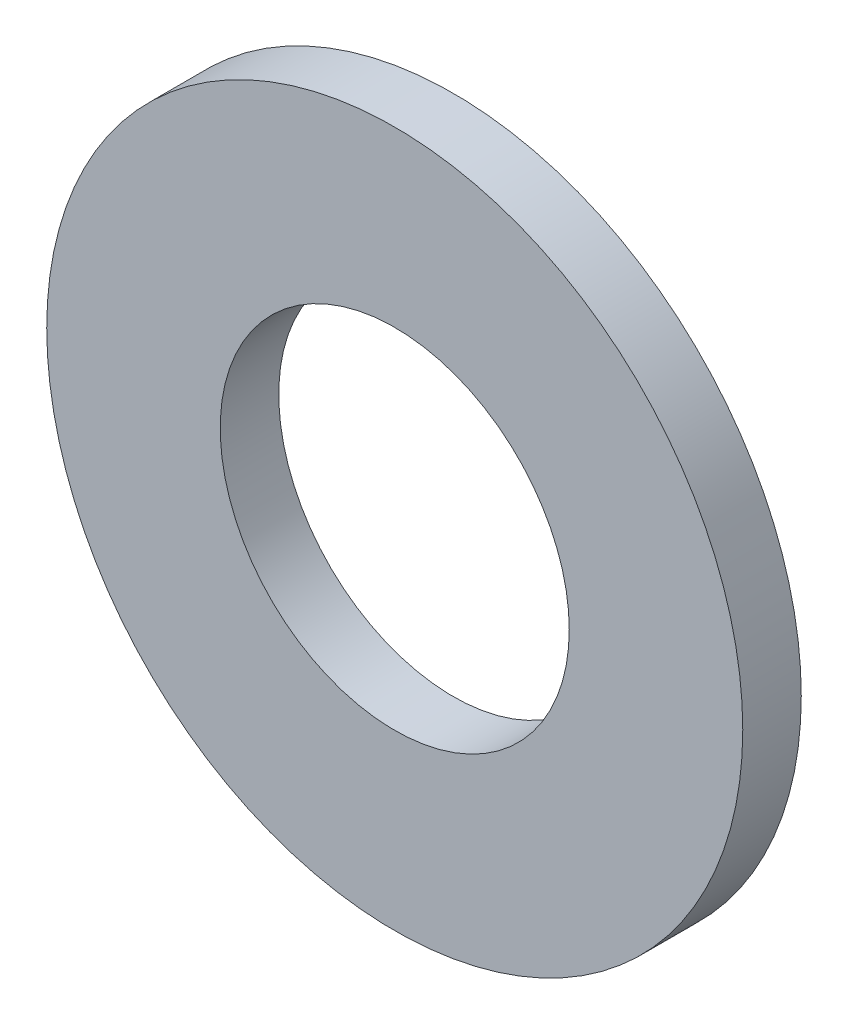
ISO-10303-21;
HEADER;
FILE_DESCRIPTION(('STEP AP214'),'2;1');
FILE_NAME('part.step','',(''),(''),'','','');
FILE_SCHEMA(('AUTOMOTIVE_DESIGN { 1 0 10303 214 1 1 1 1 }'));
ENDSEC;
DATA;
#1=APPLICATION_CONTEXT('core data for automotive mechanical design processes');
#2=APPLICATION_PROTOCOL_DEFINITION('international standard','automotive_design',2000,#1);
#3=PRODUCT_CONTEXT('',#1,'mechanical');
#4=PRODUCT('Part','Part','',(#3));
#5=PRODUCT_RELATED_PRODUCT_CATEGORY('part','',(#4));
#6=PRODUCT_DEFINITION_FORMATION('','',#4);
#7=PRODUCT_DEFINITION_CONTEXT('part definition',#1,'design');
#8=PRODUCT_DEFINITION('design','',#6,#7);
#9=PRODUCT_DEFINITION_SHAPE('','',#8);
#10=(LENGTH_UNIT() NAMED_UNIT(*) SI_UNIT(.MILLI.,.METRE.));
#11=(NAMED_UNIT(*) PLANE_ANGLE_UNIT() SI_UNIT($,.RADIAN.));
#12=(NAMED_UNIT(*) SI_UNIT($,.STERADIAN.) SOLID_ANGLE_UNIT());
#13=UNCERTAINTY_MEASURE_WITH_UNIT(LENGTH_MEASURE(1.E-05),#10,'distance_accuracy_value','');
#14=(GEOMETRIC_REPRESENTATION_CONTEXT(3) GLOBAL_UNCERTAINTY_ASSIGNED_CONTEXT((#13)) GLOBAL_UNIT_ASSIGNED_CONTEXT((#10,
#11,#12)) REPRESENTATION_CONTEXT('',''));
#15=CARTESIAN_POINT('',(0.,0.,0.));
#16=DIRECTION('',(0.,0.,1.));
#17=DIRECTION('',(1.,0.,0.));
#18=AXIS2_PLACEMENT_3D('',#15,#16,#17);
#19=CARTESIAN_POINT('',(0.,0.,1.4732));
#20=DIRECTION('',(0.,0.,-1.));
#21=DIRECTION('',(-1.,0.,0.));
#22=AXIS2_PLACEMENT_3D('',#19,#20,#21);
#23=CYLINDRICAL_SURFACE('',#22,4.3942);
#24=CARTESIAN_POINT('',(0.,0.,1.4732));
#25=DIRECTION('',(0.,0.,-1.));
#26=DIRECTION('',(1.,0.,0.));
#27=AXIS2_PLACEMENT_3D('',#24,#25,#26);
#28=CIRCLE('',#27,4.3942);
#29=CARTESIAN_POINT('',(4.3942,0.,1.4732));
#30=VERTEX_POINT('',#29);
#31=EDGE_CURVE('E8',#30,#30,#28,.T.);
#32=ORIENTED_EDGE('',*,*,#31,.F.);
#33=EDGE_LOOP('',(#32));
#34=FACE_BOUND('',#33,.T.);
#35=CARTESIAN_POINT('',(0.,0.,0.));
#36=DIRECTION('',(0.,0.,-1.));
#37=DIRECTION('',(1.,0.,0.));
#38=AXIS2_PLACEMENT_3D('',#35,#36,#37);
#39=CIRCLE('',#38,4.3942);
#40=CARTESIAN_POINT('',(4.3942,0.,0.));
#41=VERTEX_POINT('',#40);
#42=EDGE_CURVE('E23',#41,#41,#39,.T.);
#43=ORIENTED_EDGE('',*,*,#42,.T.);
#44=EDGE_LOOP('',(#43));
#45=FACE_BOUND('',#44,.T.);
#46=ADVANCED_FACE('F12',(#34,#45),#23,.F.);
#47=CARTESIAN_POINT('',(0.,0.,1.4732));
#48=DIRECTION('',(0.,0.,-1.));
#49=DIRECTION('',(-1.,0.,0.));
#50=AXIS2_PLACEMENT_3D('',#47,#48,#49);
#51=CYLINDRICAL_SURFACE('',#50,8.763);
#52=CARTESIAN_POINT('',(0.,0.,1.4732));
#53=DIRECTION('',(0.,0.,-1.));
#54=DIRECTION('',(1.,0.,0.));
#55=AXIS2_PLACEMENT_3D('',#52,#53,#54);
#56=CIRCLE('',#55,8.763);
#57=CARTESIAN_POINT('',(8.763,0.,1.4732));
#58=VERTEX_POINT('',#57);
#59=EDGE_CURVE('E19',#58,#58,#56,.T.);
#60=ORIENTED_EDGE('',*,*,#59,.T.);
#61=EDGE_LOOP('',(#60));
#62=FACE_BOUND('',#61,.T.);
#63=CARTESIAN_POINT('',(0.,0.,0.));
#64=DIRECTION('',(0.,0.,-1.));
#65=DIRECTION('',(1.,0.,0.));
#66=AXIS2_PLACEMENT_3D('',#63,#64,#65);
#67=CIRCLE('',#66,8.763);
#68=CARTESIAN_POINT('',(8.763,0.,0.));
#69=VERTEX_POINT('',#68);
#70=EDGE_CURVE('E28',#69,#69,#67,.T.);
#71=ORIENTED_EDGE('',*,*,#70,.F.);
#72=EDGE_LOOP('',(#71));
#73=FACE_BOUND('',#72,.T.);
#74=ADVANCED_FACE('F14',(#62,#73),#51,.T.);
#75=CARTESIAN_POINT('',(0.,0.,1.4732));
#76=DIRECTION('',(0.,0.,-1.));
#77=DIRECTION('',(-1.,0.,0.));
#78=AXIS2_PLACEMENT_3D('',#75,#76,#77);
#79=PLANE('',#78);
#80=ORIENTED_EDGE('',*,*,#31,.T.);
#81=EDGE_LOOP('',(#80));
#82=FACE_BOUND('',#81,.T.);
#83=ORIENTED_EDGE('',*,*,#59,.F.);
#84=EDGE_LOOP('',(#83));
#85=FACE_BOUND('',#84,.T.);
#86=ADVANCED_FACE('F40',(#82,#85),#79,.F.);
#87=CARTESIAN_POINT('',(0.,0.,0.));
#88=DIRECTION('',(0.,0.,-1.));
#89=DIRECTION('',(-1.,0.,0.));
#90=AXIS2_PLACEMENT_3D('',#87,#88,#89);
#91=PLANE('',#90);
#92=ORIENTED_EDGE('',*,*,#42,.F.);
#93=EDGE_LOOP('',(#92));
#94=FACE_BOUND('',#93,.T.);
#95=ORIENTED_EDGE('',*,*,#70,.T.);
#96=EDGE_LOOP('',(#95));
#97=FACE_BOUND('',#96,.T.);
#98=ADVANCED_FACE('F37',(#94,#97),#91,.T.);
#99=CLOSED_SHELL('',(#46,#74,#86,#98));
#100=MANIFOLD_SOLID_BREP('B1',#99);
#101=ADVANCED_BREP_SHAPE_REPRESENTATION('',(#18,#100),#14);
#102=SHAPE_DEFINITION_REPRESENTATION(#9,#101);
ENDSEC;
END-ISO-10303-21;
